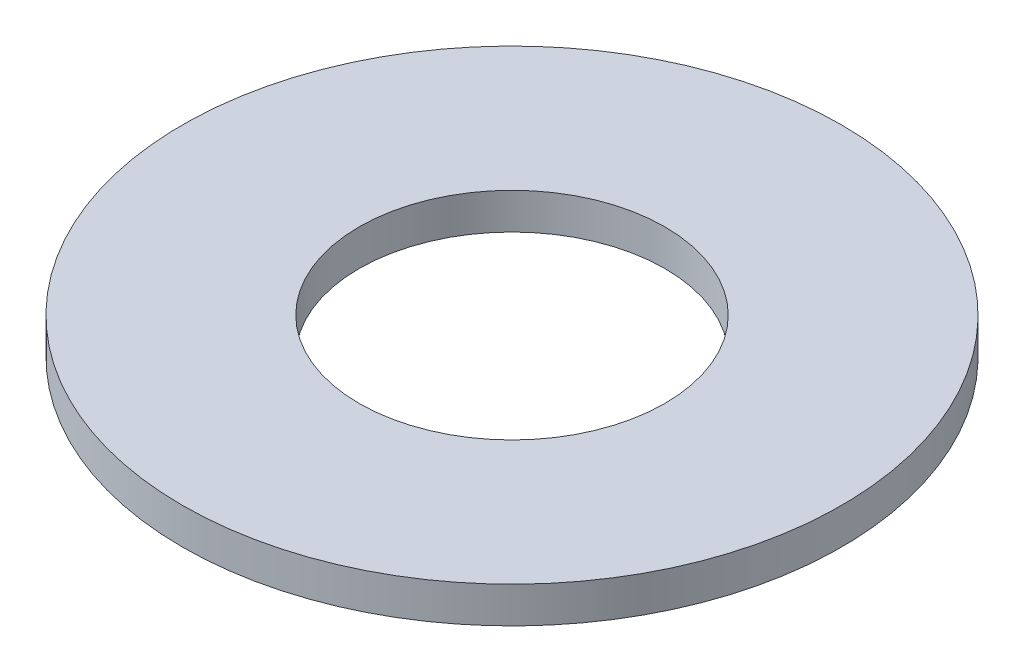
ISO-10303-21;
HEADER;
FILE_DESCRIPTION(('STEP AP214'),'2;1');
FILE_NAME('part.step','',(''),(''),'','','');
FILE_SCHEMA(('AUTOMOTIVE_DESIGN { 1 0 10303 214 1 1 1 1 }'));
ENDSEC;
DATA;
#1=APPLICATION_CONTEXT('core data for automotive mechanical design processes');
#2=APPLICATION_PROTOCOL_DEFINITION('international standard','automotive_design',2000,#1);
#3=PRODUCT_CONTEXT('',#1,'mechanical');
#4=PRODUCT('Part','Part','',(#3));
#5=PRODUCT_RELATED_PRODUCT_CATEGORY('part','',(#4));
#6=PRODUCT_DEFINITION_FORMATION('','',#4);
#7=PRODUCT_DEFINITION_CONTEXT('part definition',#1,'design');
#8=PRODUCT_DEFINITION('design','',#6,#7);
#9=PRODUCT_DEFINITION_SHAPE('','',#8);
#10=(LENGTH_UNIT() NAMED_UNIT(*) SI_UNIT(.MILLI.,.METRE.));
#11=(NAMED_UNIT(*) PLANE_ANGLE_UNIT() SI_UNIT($,.RADIAN.));
#12=(NAMED_UNIT(*) SI_UNIT($,.STERADIAN.) SOLID_ANGLE_UNIT());
#13=UNCERTAINTY_MEASURE_WITH_UNIT(LENGTH_MEASURE(1.E-05),#10,'distance_accuracy_value','');
#14=(GEOMETRIC_REPRESENTATION_CONTEXT(3) GLOBAL_UNCERTAINTY_ASSIGNED_CONTEXT((#13)) GLOBAL_UNIT_ASSIGNED_CONTEXT((#10,
#11,#12)) REPRESENTATION_CONTEXT('',''));
#15=CARTESIAN_POINT('',(0.,0.,0.));
#16=DIRECTION('',(0.,0.,1.));
#17=DIRECTION('',(1.,0.,0.));
#18=AXIS2_PLACEMENT_3D('',#15,#16,#17);
#19=CARTESIAN_POINT('',(0.,0.6096,0.));
#20=DIRECTION('',(0.,-1.,0.));
#21=DIRECTION('',(0.,0.,-1.));
#22=AXIS2_PLACEMENT_3D('',#19,#20,#21);
#23=CYLINDRICAL_SURFACE('',#22,5.55625);
#24=CARTESIAN_POINT('',(0.,0.6096,0.));
#25=DIRECTION('',(0.,1.,0.));
#26=DIRECTION('',(0.,0.,1.));
#27=AXIS2_PLACEMENT_3D('',#24,#25,#26);
#28=CIRCLE('',#27,5.55625);
#29=CARTESIAN_POINT('',(0.,0.6096,5.55625));
#30=VERTEX_POINT('',#29);
#31=EDGE_CURVE('E10',#30,#30,#28,.T.);
#32=ORIENTED_EDGE('',*,*,#31,.F.);
#33=EDGE_LOOP('',(#32));
#34=FACE_BOUND('',#33,.T.);
#35=CARTESIAN_POINT('',(0.,0.,0.));
#36=DIRECTION('',(0.,1.,0.));
#37=DIRECTION('',(0.,0.,1.));
#38=AXIS2_PLACEMENT_3D('',#35,#36,#37);
#39=CIRCLE('',#38,5.55625);
#40=CARTESIAN_POINT('',(0.,0.,5.55625));
#41=VERTEX_POINT('',#40);
#42=EDGE_CURVE('E37',#41,#41,#39,.T.);
#43=ORIENTED_EDGE('',*,*,#42,.T.);
#44=EDGE_LOOP('',(#43));
#45=FACE_BOUND('',#44,.T.);
#46=ADVANCED_FACE('F34',(#34,#45),#23,.T.);
#47=CARTESIAN_POINT('',(0.,0.6096,0.));
#48=DIRECTION('',(0.,1.,0.));
#49=DIRECTION('',(0.,0.,1.));
#50=AXIS2_PLACEMENT_3D('',#47,#48,#49);
#51=PLANE('',#50);
#52=CARTESIAN_POINT('',(0.,0.6096,0.));
#53=DIRECTION('',(0.,1.,0.));
#54=DIRECTION('',(0.,0.,1.));
#55=AXIS2_PLACEMENT_3D('',#52,#53,#54);
#56=CIRCLE('',#55,2.5781);
#57=CARTESIAN_POINT('',(0.,0.6096,2.5781));
#58=VERTEX_POINT('',#57);
#59=EDGE_CURVE('E46',#58,#58,#56,.T.);
#60=ORIENTED_EDGE('',*,*,#59,.F.);
#61=EDGE_LOOP('',(#60));
#62=FACE_BOUND('',#61,.T.);
#63=ORIENTED_EDGE('',*,*,#31,.T.);
#64=EDGE_LOOP('',(#63));
#65=FACE_BOUND('',#64,.T.);
#66=ADVANCED_FACE('F61',(#62,#65),#51,.T.);
#67=CARTESIAN_POINT('',(0.,0.,0.));
#68=DIRECTION('',(0.,1.,0.));
#69=DIRECTION('',(0.,0.,1.));
#70=AXIS2_PLACEMENT_3D('',#67,#68,#69);
#71=PLANE('',#70);
#72=CARTESIAN_POINT('',(0.,0.,0.));
#73=DIRECTION('',(0.,1.,0.));
#74=DIRECTION('',(0.,0.,1.));
#75=AXIS2_PLACEMENT_3D('',#72,#73,#74);
#76=CIRCLE('',#75,2.5781);
#77=CARTESIAN_POINT('',(0.,0.,2.5781));
#78=VERTEX_POINT('',#77);
#79=EDGE_CURVE('E44',#78,#78,#76,.T.);
#80=ORIENTED_EDGE('',*,*,#79,.T.);
#81=EDGE_LOOP('',(#80));
#82=FACE_BOUND('',#81,.T.);
#83=ORIENTED_EDGE('',*,*,#42,.F.);
#84=EDGE_LOOP('',(#83));
#85=FACE_BOUND('',#84,.T.);
#86=ADVANCED_FACE('F52',(#82,#85),#71,.F.);
#87=CARTESIAN_POINT('',(0.,0.,0.));
#88=DIRECTION('',(0.,1.,0.));
#89=DIRECTION('',(0.,0.,1.));
#90=AXIS2_PLACEMENT_3D('',#87,#88,#89);
#91=CYLINDRICAL_SURFACE('',#90,2.5781);
#92=ORIENTED_EDGE('',*,*,#79,.F.);
#93=EDGE_LOOP('',(#92));
#94=FACE_BOUND('',#93,.T.);
#95=ORIENTED_EDGE('',*,*,#59,.T.);
#96=EDGE_LOOP('',(#95));
#97=FACE_BOUND('',#96,.T.);
#98=ADVANCED_FACE('F55',(#94,#97),#91,.F.);
#99=CLOSED_SHELL('',(#46,#66,#86,#98));
#100=MANIFOLD_SOLID_BREP('B2',#99);
#101=ADVANCED_BREP_SHAPE_REPRESENTATION('',(#18,#100),#14);
#102=SHAPE_DEFINITION_REPRESENTATION(#9,#101);
ENDSEC;
END-ISO-10303-21;
